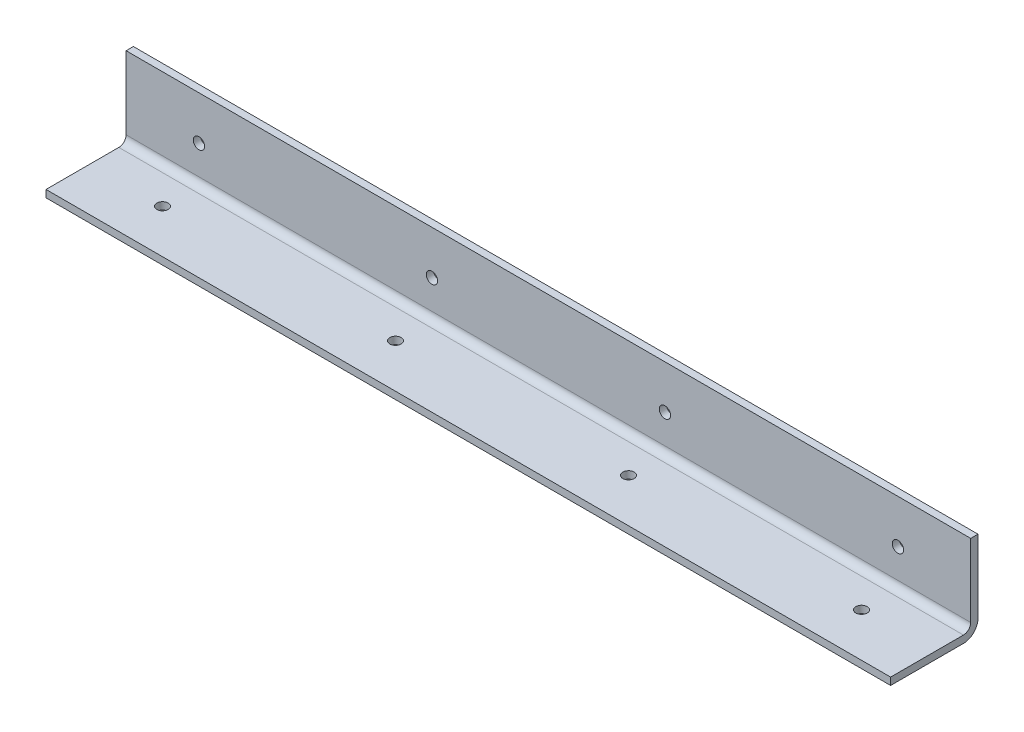
ISO-10303-21;
HEADER;
FILE_DESCRIPTION(('STEP AP214'),'2;1');
FILE_NAME('part.step','',(''),(''),'','','');
FILE_SCHEMA(('AUTOMOTIVE_DESIGN { 1 0 10303 214 1 1 1 1 }'));
ENDSEC;
DATA;
#1=APPLICATION_CONTEXT('core data for automotive mechanical design processes');
#2=APPLICATION_PROTOCOL_DEFINITION('international standard','automotive_design',2000,#1);
#3=PRODUCT_CONTEXT('',#1,'mechanical');
#4=PRODUCT('Part','Part','',(#3));
#5=PRODUCT_RELATED_PRODUCT_CATEGORY('part','',(#4));
#6=PRODUCT_DEFINITION_FORMATION('','',#4);
#7=PRODUCT_DEFINITION_CONTEXT('part definition',#1,'design');
#8=PRODUCT_DEFINITION('design','',#6,#7);
#9=PRODUCT_DEFINITION_SHAPE('','',#8);
#10=(LENGTH_UNIT() NAMED_UNIT(*) SI_UNIT(.MILLI.,.METRE.));
#11=(NAMED_UNIT(*) PLANE_ANGLE_UNIT() SI_UNIT($,.RADIAN.));
#12=(NAMED_UNIT(*) SI_UNIT($,.STERADIAN.) SOLID_ANGLE_UNIT());
#13=UNCERTAINTY_MEASURE_WITH_UNIT(LENGTH_MEASURE(1.E-05),#10,'distance_accuracy_value','');
#14=(GEOMETRIC_REPRESENTATION_CONTEXT(3) GLOBAL_UNCERTAINTY_ASSIGNED_CONTEXT((#13)) GLOBAL_UNIT_ASSIGNED_CONTEXT((#10,
#11,#12)) REPRESENTATION_CONTEXT('',''));
#15=CARTESIAN_POINT('',(0.,0.,0.));
#16=DIRECTION('',(0.,0.,1.));
#17=DIRECTION('',(1.,0.,0.));
#18=AXIS2_PLACEMENT_3D('',#15,#16,#17);
#19=CARTESIAN_POINT('',(184.15,38.1,3.175));
#20=DIRECTION('',(0.,-1.,0.));
#21=DIRECTION('',(0.,0.,-1.));
#22=AXIS2_PLACEMENT_3D('',#19,#20,#21);
#23=PLANE('',#22);
#24=DIRECTION('',(0.,0.,1.));
#25=VECTOR('',#24,1.);
#26=CARTESIAN_POINT('',(-184.15,38.1,3.175));
#27=LINE('',#26,#25);
#28=CARTESIAN_POINT('',(-184.15,38.1,0.));
#29=VERTEX_POINT('',#28);
#30=CARTESIAN_POINT('',(-184.15,38.1,3.175));
#31=VERTEX_POINT('',#30);
#32=EDGE_CURVE('E124',#29,#31,#27,.T.);
#33=ORIENTED_EDGE('',*,*,#32,.T.);
#34=DIRECTION('',(-1.,0.,0.));
#35=VECTOR('',#34,1.);
#36=CARTESIAN_POINT('',(184.15,38.1,3.175));
#37=LINE('',#36,#35);
#38=CARTESIAN_POINT('',(184.15,38.1,3.175));
#39=VERTEX_POINT('',#38);
#40=EDGE_CURVE('E105',#39,#31,#37,.T.);
#41=ORIENTED_EDGE('',*,*,#40,.F.);
#42=DIRECTION('',(0.,0.,1.));
#43=VECTOR('',#42,1.);
#44=CARTESIAN_POINT('',(184.15,38.1,3.175));
#45=LINE('',#44,#43);
#46=CARTESIAN_POINT('',(184.15,38.1,0.));
#47=VERTEX_POINT('',#46);
#48=EDGE_CURVE('E112',#47,#39,#45,.T.);
#49=ORIENTED_EDGE('',*,*,#48,.F.);
#50=DIRECTION('',(-1.,0.,0.));
#51=VECTOR('',#50,1.);
#52=CARTESIAN_POINT('',(184.15,38.1,0.));
#53=LINE('',#52,#51);
#54=EDGE_CURVE('E155',#47,#29,#53,.T.);
#55=ORIENTED_EDGE('',*,*,#54,.T.);
#56=EDGE_LOOP('',(#33,#41,#49,#55));
#57=FACE_BOUND('',#56,.T.);
#58=ADVANCED_FACE('F35',(#57),#23,.F.);
#59=CARTESIAN_POINT('',(184.15,3.17499999999999,3.175));
#60=DIRECTION('',(0.,0.,-1.));
#61=DIRECTION('',(0.,1.,0.));
#62=AXIS2_PLACEMENT_3D('',#59,#60,#61);
#63=PLANE('',#62);
#64=CARTESIAN_POINT('',(-50.8,19.05,3.175));
#65=DIRECTION('',(0.,0.,-1.));
#66=DIRECTION('',(0.,1.,0.));
#67=AXIS2_PLACEMENT_3D('',#64,#65,#66);
#68=CIRCLE('',#67,2.4638);
#69=CARTESIAN_POINT('',(-50.8,21.5138,3.175));
#70=VERTEX_POINT('',#69);
#71=EDGE_CURVE('E187',#70,#70,#68,.T.);
#72=ORIENTED_EDGE('',*,*,#71,.T.);
#73=EDGE_LOOP('',(#72));
#74=FACE_BOUND('',#73,.T.);
#75=CARTESIAN_POINT('',(50.8,19.05,3.175));
#76=DIRECTION('',(0.,0.,-1.));
#77=DIRECTION('',(0.,1.,0.));
#78=AXIS2_PLACEMENT_3D('',#75,#76,#77);
#79=CIRCLE('',#78,2.4638);
#80=CARTESIAN_POINT('',(50.8,21.5138,3.175));
#81=VERTEX_POINT('',#80);
#82=EDGE_CURVE('E196',#81,#81,#79,.T.);
#83=ORIENTED_EDGE('',*,*,#82,.T.);
#84=EDGE_LOOP('',(#83));
#85=FACE_BOUND('',#84,.T.);
#86=CARTESIAN_POINT('',(152.4,19.05,3.175));
#87=DIRECTION('',(0.,0.,-1.));
#88=DIRECTION('',(0.,1.,0.));
#89=AXIS2_PLACEMENT_3D('',#86,#87,#88);
#90=CIRCLE('',#89,2.4638);
#91=CARTESIAN_POINT('',(152.4,21.5138,3.175));
#92=VERTEX_POINT('',#91);
#93=EDGE_CURVE('E188',#92,#92,#90,.T.);
#94=ORIENTED_EDGE('',*,*,#93,.T.);
#95=EDGE_LOOP('',(#94));
#96=FACE_BOUND('',#95,.T.);
#97=CARTESIAN_POINT('',(-152.4,19.05,3.175));
#98=DIRECTION('',(0.,0.,-1.));
#99=DIRECTION('',(0.,1.,0.));
#100=AXIS2_PLACEMENT_3D('',#97,#98,#99);
#101=CIRCLE('',#100,2.4638);
#102=CARTESIAN_POINT('',(-152.4,21.5138,3.175));
#103=VERTEX_POINT('',#102);
#104=EDGE_CURVE('E170',#103,#103,#101,.T.);
#105=ORIENTED_EDGE('',*,*,#104,.T.);
#106=EDGE_LOOP('',(#105));
#107=FACE_BOUND('',#106,.T.);
#108=DIRECTION('',(0.,-1.,0.));
#109=VECTOR('',#108,1.);
#110=CARTESIAN_POINT('',(-184.15,3.17499999999999,3.175));
#111=LINE('',#110,#109);
#112=CARTESIAN_POINT('',(-184.15,6.34999999999999,3.175));
#113=VERTEX_POINT('',#112);
#114=EDGE_CURVE('E165',#31,#113,#111,.T.);
#115=ORIENTED_EDGE('',*,*,#114,.T.);
#116=DIRECTION('',(-1.,0.,0.));
#117=VECTOR('',#116,1.);
#118=CARTESIAN_POINT('',(184.15,6.34999999999999,3.175));
#119=LINE('',#118,#117);
#120=CARTESIAN_POINT('',(184.15,6.34999999999999,3.175));
#121=VERTEX_POINT('',#120);
#122=EDGE_CURVE('E108',#113,#121,#119,.F.);
#123=ORIENTED_EDGE('',*,*,#122,.T.);
#124=DIRECTION('',(0.,-1.,0.));
#125=VECTOR('',#124,1.);
#126=CARTESIAN_POINT('',(184.15,3.17499999999999,3.175));
#127=LINE('',#126,#125);
#128=EDGE_CURVE('E100',#39,#121,#127,.T.);
#129=ORIENTED_EDGE('',*,*,#128,.F.);
#130=ORIENTED_EDGE('',*,*,#40,.T.);
#131=EDGE_LOOP('',(#115,#123,#129,#130));
#132=FACE_BOUND('',#131,.T.);
#133=ADVANCED_FACE('F103',(#74,#85,#96,#107,#132),#63,.F.);
#134=CARTESIAN_POINT('',(184.15,3.17499999999999,38.1));
#135=DIRECTION('',(0.,-1.,0.));
#136=DIRECTION('',(0.,0.,-1.));
#137=AXIS2_PLACEMENT_3D('',#134,#135,#136);
#138=PLANE('',#137);
#139=CARTESIAN_POINT('',(-50.8,3.175,19.05));
#140=DIRECTION('',(0.,-1.,0.));
#141=DIRECTION('',(0.,0.,-1.));
#142=AXIS2_PLACEMENT_3D('',#139,#140,#141);
#143=CIRCLE('',#142,2.4638);
#144=CARTESIAN_POINT('',(-50.8,3.175,16.5862));
#145=VERTEX_POINT('',#144);
#146=EDGE_CURVE('E195',#145,#145,#143,.T.);
#147=ORIENTED_EDGE('',*,*,#146,.T.);
#148=EDGE_LOOP('',(#147));
#149=FACE_BOUND('',#148,.T.);
#150=CARTESIAN_POINT('',(50.8,3.175,19.05));
#151=DIRECTION('',(0.,-1.,0.));
#152=DIRECTION('',(0.,0.,-1.));
#153=AXIS2_PLACEMENT_3D('',#150,#151,#152);
#154=CIRCLE('',#153,2.4638);
#155=CARTESIAN_POINT('',(50.8,3.175,16.5862));
#156=VERTEX_POINT('',#155);
#157=EDGE_CURVE('E208',#156,#156,#154,.T.);
#158=ORIENTED_EDGE('',*,*,#157,.T.);
#159=EDGE_LOOP('',(#158));
#160=FACE_BOUND('',#159,.T.);
#161=CARTESIAN_POINT('',(152.4,3.175,19.05));
#162=DIRECTION('',(0.,-1.,0.));
#163=DIRECTION('',(0.,0.,-1.));
#164=AXIS2_PLACEMENT_3D('',#161,#162,#163);
#165=CIRCLE('',#164,2.4638);
#166=CARTESIAN_POINT('',(152.4,3.175,16.5862));
#167=VERTEX_POINT('',#166);
#168=EDGE_CURVE('E211',#167,#167,#165,.T.);
#169=ORIENTED_EDGE('',*,*,#168,.T.);
#170=EDGE_LOOP('',(#169));
#171=FACE_BOUND('',#170,.T.);
#172=CARTESIAN_POINT('',(-152.4,3.175,19.05));
#173=DIRECTION('',(0.,-1.,0.));
#174=DIRECTION('',(0.,0.,-1.));
#175=AXIS2_PLACEMENT_3D('',#172,#173,#174);
#176=CIRCLE('',#175,2.4638);
#177=CARTESIAN_POINT('',(-152.4,3.175,16.5862));
#178=VERTEX_POINT('',#177);
#179=EDGE_CURVE('E181',#178,#178,#176,.T.);
#180=ORIENTED_EDGE('',*,*,#179,.T.);
#181=EDGE_LOOP('',(#180));
#182=FACE_BOUND('',#181,.T.);
#183=DIRECTION('',(0.,0.,1.));
#184=VECTOR('',#183,1.);
#185=CARTESIAN_POINT('',(184.15,3.17499999999999,38.1));
#186=LINE('',#185,#184);
#187=CARTESIAN_POINT('',(184.15,3.17499999999999,6.34999999999999));
#188=VERTEX_POINT('',#187);
#189=CARTESIAN_POINT('',(184.15,3.17499999999999,38.1));
#190=VERTEX_POINT('',#189);
#191=EDGE_CURVE('E111',#188,#190,#186,.T.);
#192=ORIENTED_EDGE('',*,*,#191,.F.);
#193=DIRECTION('',(-1.,0.,0.));
#194=VECTOR('',#193,1.);
#195=CARTESIAN_POINT('',(-184.15,3.17499999999999,6.34999999999999));
#196=LINE('',#195,#194);
#197=CARTESIAN_POINT('',(-184.15,3.17499999999999,6.34999999999999));
#198=VERTEX_POINT('',#197);
#199=EDGE_CURVE('E125',#188,#198,#196,.T.);
#200=ORIENTED_EDGE('',*,*,#199,.T.);
#201=DIRECTION('',(0.,0.,1.));
#202=VECTOR('',#201,1.);
#203=CARTESIAN_POINT('',(-184.15,3.17499999999999,38.1));
#204=LINE('',#203,#202);
#205=CARTESIAN_POINT('',(-184.15,3.17499999999999,38.1));
#206=VERTEX_POINT('',#205);
#207=EDGE_CURVE('E164',#198,#206,#204,.T.);
#208=ORIENTED_EDGE('',*,*,#207,.T.);
#209=DIRECTION('',(-1.,0.,0.));
#210=VECTOR('',#209,1.);
#211=CARTESIAN_POINT('',(184.15,3.17499999999999,38.1));
#212=LINE('',#211,#210);
#213=EDGE_CURVE('E126',#190,#206,#212,.T.);
#214=ORIENTED_EDGE('',*,*,#213,.F.);
#215=EDGE_LOOP('',(#192,#200,#208,#214));
#216=FACE_BOUND('',#215,.T.);
#217=ADVANCED_FACE('F245',(#149,#160,#171,#182,#216),#138,.F.);
#218=CARTESIAN_POINT('',(184.15,0.,38.1));
#219=DIRECTION('',(0.,0.,-1.));
#220=DIRECTION('',(-1.,0.,0.));
#221=AXIS2_PLACEMENT_3D('',#218,#219,#220);
#222=PLANE('',#221);
#223=DIRECTION('',(0.,-1.,0.));
#224=VECTOR('',#223,1.);
#225=CARTESIAN_POINT('',(-184.15,0.,38.1));
#226=LINE('',#225,#224);
#227=CARTESIAN_POINT('',(-184.15,0.,38.1));
#228=VERTEX_POINT('',#227);
#229=EDGE_CURVE('E151',#206,#228,#226,.T.);
#230=ORIENTED_EDGE('',*,*,#229,.T.);
#231=DIRECTION('',(-1.,0.,0.));
#232=VECTOR('',#231,1.);
#233=CARTESIAN_POINT('',(184.15,0.,38.1));
#234=LINE('',#233,#232);
#235=CARTESIAN_POINT('',(184.15,0.,38.1));
#236=VERTEX_POINT('',#235);
#237=EDGE_CURVE('E131',#236,#228,#234,.T.);
#238=ORIENTED_EDGE('',*,*,#237,.F.);
#239=DIRECTION('',(0.,-1.,0.));
#240=VECTOR('',#239,1.);
#241=CARTESIAN_POINT('',(184.15,0.,38.1));
#242=LINE('',#241,#240);
#243=EDGE_CURVE('E173',#190,#236,#242,.T.);
#244=ORIENTED_EDGE('',*,*,#243,.F.);
#245=ORIENTED_EDGE('',*,*,#213,.T.);
#246=EDGE_LOOP('',(#230,#238,#244,#245));
#247=FACE_BOUND('',#246,.T.);
#248=ADVANCED_FACE('F229',(#247),#222,.F.);
#249=CARTESIAN_POINT('',(184.15,0.,0.));
#250=DIRECTION('',(0.,1.,0.));
#251=DIRECTION('',(0.,0.,1.));
#252=AXIS2_PLACEMENT_3D('',#249,#250,#251);
#253=PLANE('',#252);
#254=CARTESIAN_POINT('',(-50.8,0.,19.05));
#255=DIRECTION('',(0.,-1.,0.));
#256=DIRECTION('',(0.,0.,-1.));
#257=AXIS2_PLACEMENT_3D('',#254,#255,#256);
#258=CIRCLE('',#257,2.4638);
#259=CARTESIAN_POINT('',(-50.8,0.,16.5862));
#260=VERTEX_POINT('',#259);
#261=EDGE_CURVE('E214',#260,#260,#258,.T.);
#262=ORIENTED_EDGE('',*,*,#261,.F.);
#263=EDGE_LOOP('',(#262));
#264=FACE_BOUND('',#263,.T.);
#265=CARTESIAN_POINT('',(50.8,0.,19.05));
#266=DIRECTION('',(0.,-1.,0.));
#267=DIRECTION('',(0.,0.,-1.));
#268=AXIS2_PLACEMENT_3D('',#265,#266,#267);
#269=CIRCLE('',#268,2.4638);
#270=CARTESIAN_POINT('',(50.8,0.,16.5862));
#271=VERTEX_POINT('',#270);
#272=EDGE_CURVE('E218',#271,#271,#269,.T.);
#273=ORIENTED_EDGE('',*,*,#272,.F.);
#274=EDGE_LOOP('',(#273));
#275=FACE_BOUND('',#274,.T.);
#276=CARTESIAN_POINT('',(152.4,0.,19.05));
#277=DIRECTION('',(0.,-1.,0.));
#278=DIRECTION('',(0.,0.,-1.));
#279=AXIS2_PLACEMENT_3D('',#276,#277,#278);
#280=CIRCLE('',#279,2.4638);
#281=CARTESIAN_POINT('',(152.4,0.,16.5862));
#282=VERTEX_POINT('',#281);
#283=EDGE_CURVE('E215',#282,#282,#280,.T.);
#284=ORIENTED_EDGE('',*,*,#283,.F.);
#285=EDGE_LOOP('',(#284));
#286=FACE_BOUND('',#285,.T.);
#287=CARTESIAN_POINT('',(-152.4,0.,19.05));
#288=DIRECTION('',(0.,-1.,0.));
#289=DIRECTION('',(0.,0.,-1.));
#290=AXIS2_PLACEMENT_3D('',#287,#288,#289);
#291=CIRCLE('',#290,2.4638);
#292=CARTESIAN_POINT('',(-152.4,0.,16.5862));
#293=VERTEX_POINT('',#292);
#294=EDGE_CURVE('E184',#293,#293,#291,.T.);
#295=ORIENTED_EDGE('',*,*,#294,.F.);
#296=EDGE_LOOP('',(#295));
#297=FACE_BOUND('',#296,.T.);
#298=DIRECTION('',(0.,0.,-1.));
#299=VECTOR('',#298,1.);
#300=CARTESIAN_POINT('',(-184.15,0.,0.));
#301=LINE('',#300,#299);
#302=CARTESIAN_POINT('',(-184.15,0.,6.35));
#303=VERTEX_POINT('',#302);
#304=EDGE_CURVE('E149',#228,#303,#301,.T.);
#305=ORIENTED_EDGE('',*,*,#304,.T.);
#306=DIRECTION('',(-1.,0.,0.));
#307=VECTOR('',#306,1.);
#308=CARTESIAN_POINT('',(184.15,0.,6.35));
#309=LINE('',#308,#307);
#310=CARTESIAN_POINT('',(184.15,0.,6.35));
#311=VERTEX_POINT('',#310);
#312=EDGE_CURVE('E43',#303,#311,#309,.F.);
#313=ORIENTED_EDGE('',*,*,#312,.T.);
#314=DIRECTION('',(0.,0.,-1.));
#315=VECTOR('',#314,1.);
#316=CARTESIAN_POINT('',(184.15,0.,0.));
#317=LINE('',#316,#315);
#318=EDGE_CURVE('E159',#236,#311,#317,.T.);
#319=ORIENTED_EDGE('',*,*,#318,.F.);
#320=ORIENTED_EDGE('',*,*,#237,.T.);
#321=EDGE_LOOP('',(#305,#313,#319,#320));
#322=FACE_BOUND('',#321,.T.);
#323=ADVANCED_FACE('F158',(#264,#275,#286,#297,#322),#253,.F.);
#324=CARTESIAN_POINT('',(184.15,38.1,0.));
#325=DIRECTION('',(0.,0.,1.));
#326=DIRECTION('',(0.,-1.,0.));
#327=AXIS2_PLACEMENT_3D('',#324,#325,#326);
#328=PLANE('',#327);
#329=CARTESIAN_POINT('',(-50.8,19.05,0.));
#330=DIRECTION('',(0.,0.,-1.));
#331=DIRECTION('',(0.,1.,0.));
#332=AXIS2_PLACEMENT_3D('',#329,#330,#331);
#333=CIRCLE('',#332,2.4638);
#334=CARTESIAN_POINT('',(-50.8,21.5138,0.));
#335=VERTEX_POINT('',#334);
#336=EDGE_CURVE('E199',#335,#335,#333,.T.);
#337=ORIENTED_EDGE('',*,*,#336,.F.);
#338=EDGE_LOOP('',(#337));
#339=FACE_BOUND('',#338,.T.);
#340=CARTESIAN_POINT('',(50.8,19.05,0.));
#341=DIRECTION('',(0.,0.,-1.));
#342=DIRECTION('',(0.,1.,0.));
#343=AXIS2_PLACEMENT_3D('',#340,#341,#342);
#344=CIRCLE('',#343,2.4638);
#345=CARTESIAN_POINT('',(50.8,21.5138,0.));
#346=VERTEX_POINT('',#345);
#347=EDGE_CURVE('E191',#346,#346,#344,.T.);
#348=ORIENTED_EDGE('',*,*,#347,.F.);
#349=EDGE_LOOP('',(#348));
#350=FACE_BOUND('',#349,.T.);
#351=CARTESIAN_POINT('',(152.4,19.05,0.));
#352=DIRECTION('',(0.,0.,-1.));
#353=DIRECTION('',(0.,1.,0.));
#354=AXIS2_PLACEMENT_3D('',#351,#352,#353);
#355=CIRCLE('',#354,2.4638);
#356=CARTESIAN_POINT('',(152.4,21.5138,0.));
#357=VERTEX_POINT('',#356);
#358=EDGE_CURVE('E192',#357,#357,#355,.T.);
#359=ORIENTED_EDGE('',*,*,#358,.F.);
#360=EDGE_LOOP('',(#359));
#361=FACE_BOUND('',#360,.T.);
#362=CARTESIAN_POINT('',(-152.4,19.05,0.));
#363=DIRECTION('',(0.,0.,-1.));
#364=DIRECTION('',(0.,1.,0.));
#365=AXIS2_PLACEMENT_3D('',#362,#363,#364);
#366=CIRCLE('',#365,2.4638);
#367=CARTESIAN_POINT('',(-152.4,21.5138,0.));
#368=VERTEX_POINT('',#367);
#369=EDGE_CURVE('E178',#368,#368,#366,.T.);
#370=ORIENTED_EDGE('',*,*,#369,.F.);
#371=EDGE_LOOP('',(#370));
#372=FACE_BOUND('',#371,.T.);
#373=DIRECTION('',(0.,1.,0.));
#374=VECTOR('',#373,1.);
#375=CARTESIAN_POINT('',(184.15,38.1,0.));
#376=LINE('',#375,#374);
#377=CARTESIAN_POINT('',(184.15,6.35000000000002,0.));
#378=VERTEX_POINT('',#377);
#379=EDGE_CURVE('E117',#378,#47,#376,.T.);
#380=ORIENTED_EDGE('',*,*,#379,.F.);
#381=DIRECTION('',(-1.,0.,0.));
#382=VECTOR('',#381,1.);
#383=CARTESIAN_POINT('',(184.15,6.35,0.));
#384=LINE('',#383,#382);
#385=CARTESIAN_POINT('',(-184.15,6.35000000000002,0.));
#386=VERTEX_POINT('',#385);
#387=EDGE_CURVE('E140',#378,#386,#384,.T.);
#388=ORIENTED_EDGE('',*,*,#387,.T.);
#389=DIRECTION('',(0.,1.,0.));
#390=VECTOR('',#389,1.);
#391=CARTESIAN_POINT('',(-184.15,38.1,0.));
#392=LINE('',#391,#390);
#393=EDGE_CURVE('E121',#386,#29,#392,.T.);
#394=ORIENTED_EDGE('',*,*,#393,.T.);
#395=ORIENTED_EDGE('',*,*,#54,.F.);
#396=EDGE_LOOP('',(#380,#388,#394,#395));
#397=FACE_BOUND('',#396,.T.);
#398=ADVANCED_FACE('F145',(#339,#350,#361,#372,#397),#328,.F.);
#399=CARTESIAN_POINT('',(184.15,0.,0.));
#400=DIRECTION('',(-1.,0.,0.));
#401=DIRECTION('',(0.,0.,1.));
#402=AXIS2_PLACEMENT_3D('',#399,#400,#401);
#403=PLANE('',#402);
#404=ORIENTED_EDGE('',*,*,#318,.T.);
#405=CARTESIAN_POINT('',(184.15,6.35,6.35));
#406=DIRECTION('',(-1.,0.,0.));
#407=DIRECTION('',(0.,0.,1.));
#408=AXIS2_PLACEMENT_3D('',#405,#406,#407);
#409=CIRCLE('',#408,6.35);
#410=EDGE_CURVE('E11',#311,#378,#409,.F.);
#411=ORIENTED_EDGE('',*,*,#410,.T.);
#412=ORIENTED_EDGE('',*,*,#379,.T.);
#413=ORIENTED_EDGE('',*,*,#48,.T.);
#414=ORIENTED_EDGE('',*,*,#128,.T.);
#415=CARTESIAN_POINT('',(184.15,6.34999999999999,6.34999999999999));
#416=DIRECTION('',(-1.,0.,0.));
#417=DIRECTION('',(0.,0.,1.));
#418=AXIS2_PLACEMENT_3D('',#415,#416,#417);
#419=CIRCLE('',#418,3.175);
#420=EDGE_CURVE('E138',#121,#188,#419,.T.);
#421=ORIENTED_EDGE('',*,*,#420,.T.);
#422=ORIENTED_EDGE('',*,*,#191,.T.);
#423=ORIENTED_EDGE('',*,*,#243,.T.);
#424=EDGE_LOOP('',(#404,#411,#412,#413,#414,#421,#422,#423));
#425=FACE_BOUND('',#424,.T.);
#426=ADVANCED_FACE('F115',(#425),#403,.F.);
#427=CARTESIAN_POINT('',(-184.15,0.,0.));
#428=DIRECTION('',(-1.,0.,0.));
#429=DIRECTION('',(0.,0.,1.));
#430=AXIS2_PLACEMENT_3D('',#427,#428,#429);
#431=PLANE('',#430);
#432=ORIENTED_EDGE('',*,*,#393,.F.);
#433=CARTESIAN_POINT('',(-184.15,6.35,6.35));
#434=DIRECTION('',(-1.,0.,0.));
#435=DIRECTION('',(0.,0.,1.));
#436=AXIS2_PLACEMENT_3D('',#433,#434,#435);
#437=CIRCLE('',#436,6.35);
#438=EDGE_CURVE('E57',#386,#303,#437,.T.);
#439=ORIENTED_EDGE('',*,*,#438,.T.);
#440=ORIENTED_EDGE('',*,*,#304,.F.);
#441=ORIENTED_EDGE('',*,*,#229,.F.);
#442=ORIENTED_EDGE('',*,*,#207,.F.);
#443=CARTESIAN_POINT('',(-184.15,6.34999999999999,6.34999999999999));
#444=DIRECTION('',(-1.,0.,0.));
#445=DIRECTION('',(0.,0.,1.));
#446=AXIS2_PLACEMENT_3D('',#443,#444,#445);
#447=CIRCLE('',#446,3.175);
#448=EDGE_CURVE('E136',#198,#113,#447,.F.);
#449=ORIENTED_EDGE('',*,*,#448,.T.);
#450=ORIENTED_EDGE('',*,*,#114,.F.);
#451=ORIENTED_EDGE('',*,*,#32,.F.);
#452=EDGE_LOOP('',(#432,#439,#440,#441,#442,#449,#450,#451));
#453=FACE_BOUND('',#452,.T.);
#454=ADVANCED_FACE('F148',(#453),#431,.T.);
#455=CARTESIAN_POINT('',(184.15,6.34999999999999,6.34999999999999));
#456=DIRECTION('',(1.,0.,0.));
#457=DIRECTION('',(0.,0.,-1.));
#458=AXIS2_PLACEMENT_3D('',#455,#456,#457);
#459=CYLINDRICAL_SURFACE('',#458,3.175);
#460=ORIENTED_EDGE('',*,*,#420,.F.);
#461=ORIENTED_EDGE('',*,*,#122,.F.);
#462=ORIENTED_EDGE('',*,*,#448,.F.);
#463=ORIENTED_EDGE('',*,*,#199,.F.);
#464=EDGE_LOOP('',(#460,#461,#462,#463));
#465=FACE_BOUND('',#464,.T.);
#466=ADVANCED_FACE('F254',(#465),#459,.F.);
#467=CARTESIAN_POINT('',(184.15,6.35,6.35));
#468=DIRECTION('',(-1.,0.,0.));
#469=DIRECTION('',(0.,0.,1.));
#470=AXIS2_PLACEMENT_3D('',#467,#468,#469);
#471=CYLINDRICAL_SURFACE('',#470,6.35);
#472=ORIENTED_EDGE('',*,*,#410,.F.);
#473=ORIENTED_EDGE('',*,*,#312,.F.);
#474=ORIENTED_EDGE('',*,*,#438,.F.);
#475=ORIENTED_EDGE('',*,*,#387,.F.);
#476=EDGE_LOOP('',(#472,#473,#474,#475));
#477=FACE_BOUND('',#476,.T.);
#478=ADVANCED_FACE('F37',(#477),#471,.T.);
#479=CARTESIAN_POINT('',(-152.4,19.05,38.1));
#480=DIRECTION('',(0.,0.,-1.));
#481=DIRECTION('',(0.,1.,0.));
#482=AXIS2_PLACEMENT_3D('',#479,#480,#481);
#483=CYLINDRICAL_SURFACE('',#482,2.4638);
#484=ORIENTED_EDGE('',*,*,#369,.T.);
#485=EDGE_LOOP('',(#484));
#486=FACE_BOUND('',#485,.T.);
#487=ORIENTED_EDGE('',*,*,#104,.F.);
#488=EDGE_LOOP('',(#487));
#489=FACE_BOUND('',#488,.T.);
#490=ADVANCED_FACE('F241',(#486,#489),#483,.F.);
#491=CARTESIAN_POINT('',(-152.4,38.1,19.05));
#492=DIRECTION('',(0.,-1.,0.));
#493=DIRECTION('',(0.,0.,-1.));
#494=AXIS2_PLACEMENT_3D('',#491,#492,#493);
#495=CYLINDRICAL_SURFACE('',#494,2.4638);
#496=ORIENTED_EDGE('',*,*,#294,.T.);
#497=EDGE_LOOP('',(#496));
#498=FACE_BOUND('',#497,.T.);
#499=ORIENTED_EDGE('',*,*,#179,.F.);
#500=EDGE_LOOP('',(#499));
#501=FACE_BOUND('',#500,.T.);
#502=ADVANCED_FACE('F237',(#498,#501),#495,.F.);
#503=CARTESIAN_POINT('',(152.4,19.05,38.1));
#504=DIRECTION('',(0.,0.,-1.));
#505=DIRECTION('',(0.,1.,0.));
#506=AXIS2_PLACEMENT_3D('',#503,#504,#505);
#507=CYLINDRICAL_SURFACE('',#506,2.4638);
#508=ORIENTED_EDGE('',*,*,#358,.T.);
#509=EDGE_LOOP('',(#508));
#510=FACE_BOUND('',#509,.T.);
#511=ORIENTED_EDGE('',*,*,#93,.F.);
#512=EDGE_LOOP('',(#511));
#513=FACE_BOUND('',#512,.T.);
#514=ADVANCED_FACE('F240',(#510,#513),#507,.F.);
#515=CARTESIAN_POINT('',(50.8,19.05,38.1));
#516=DIRECTION('',(0.,0.,-1.));
#517=DIRECTION('',(0.,1.,0.));
#518=AXIS2_PLACEMENT_3D('',#515,#516,#517);
#519=CYLINDRICAL_SURFACE('',#518,2.4638);
#520=ORIENTED_EDGE('',*,*,#347,.T.);
#521=EDGE_LOOP('',(#520));
#522=FACE_BOUND('',#521,.T.);
#523=ORIENTED_EDGE('',*,*,#82,.F.);
#524=EDGE_LOOP('',(#523));
#525=FACE_BOUND('',#524,.T.);
#526=ADVANCED_FACE('F281',(#522,#525),#519,.F.);
#527=CARTESIAN_POINT('',(-50.8,19.05,38.1));
#528=DIRECTION('',(0.,0.,-1.));
#529=DIRECTION('',(0.,1.,0.));
#530=AXIS2_PLACEMENT_3D('',#527,#528,#529);
#531=CYLINDRICAL_SURFACE('',#530,2.4638);
#532=ORIENTED_EDGE('',*,*,#336,.T.);
#533=EDGE_LOOP('',(#532));
#534=FACE_BOUND('',#533,.T.);
#535=ORIENTED_EDGE('',*,*,#71,.F.);
#536=EDGE_LOOP('',(#535));
#537=FACE_BOUND('',#536,.T.);
#538=ADVANCED_FACE('F285',(#534,#537),#531,.F.);
#539=CARTESIAN_POINT('',(152.4,38.1,19.05));
#540=DIRECTION('',(0.,-1.,0.));
#541=DIRECTION('',(0.,0.,-1.));
#542=AXIS2_PLACEMENT_3D('',#539,#540,#541);
#543=CYLINDRICAL_SURFACE('',#542,2.4638);
#544=ORIENTED_EDGE('',*,*,#283,.T.);
#545=EDGE_LOOP('',(#544));
#546=FACE_BOUND('',#545,.T.);
#547=ORIENTED_EDGE('',*,*,#168,.F.);
#548=EDGE_LOOP('',(#547));
#549=FACE_BOUND('',#548,.T.);
#550=ADVANCED_FACE('F289',(#546,#549),#543,.F.);
#551=CARTESIAN_POINT('',(50.8,38.1,19.05));
#552=DIRECTION('',(0.,-1.,0.));
#553=DIRECTION('',(0.,0.,-1.));
#554=AXIS2_PLACEMENT_3D('',#551,#552,#553);
#555=CYLINDRICAL_SURFACE('',#554,2.4638);
#556=ORIENTED_EDGE('',*,*,#272,.T.);
#557=EDGE_LOOP('',(#556));
#558=FACE_BOUND('',#557,.T.);
#559=ORIENTED_EDGE('',*,*,#157,.F.);
#560=EDGE_LOOP('',(#559));
#561=FACE_BOUND('',#560,.T.);
#562=ADVANCED_FACE('F293',(#558,#561),#555,.F.);
#563=CARTESIAN_POINT('',(-50.8,38.1,19.05));
#564=DIRECTION('',(0.,-1.,0.));
#565=DIRECTION('',(0.,0.,-1.));
#566=AXIS2_PLACEMENT_3D('',#563,#564,#565);
#567=CYLINDRICAL_SURFACE('',#566,2.4638);
#568=ORIENTED_EDGE('',*,*,#261,.T.);
#569=EDGE_LOOP('',(#568));
#570=FACE_BOUND('',#569,.T.);
#571=ORIENTED_EDGE('',*,*,#146,.F.);
#572=EDGE_LOOP('',(#571));
#573=FACE_BOUND('',#572,.T.);
#574=ADVANCED_FACE('F224',(#570,#573),#567,.F.);
#575=CLOSED_SHELL('',(#58,#133,#217,#248,#323,#398,#426,#454,#466,#478,#490,#502,#514,#526,#538,
#550,#562,#574));
#576=MANIFOLD_SOLID_BREP('B2',#575);
#577=ADVANCED_BREP_SHAPE_REPRESENTATION('',(#18,#576),#14);
#578=SHAPE_DEFINITION_REPRESENTATION(#9,#577);
ENDSEC;
END-ISO-10303-21;
